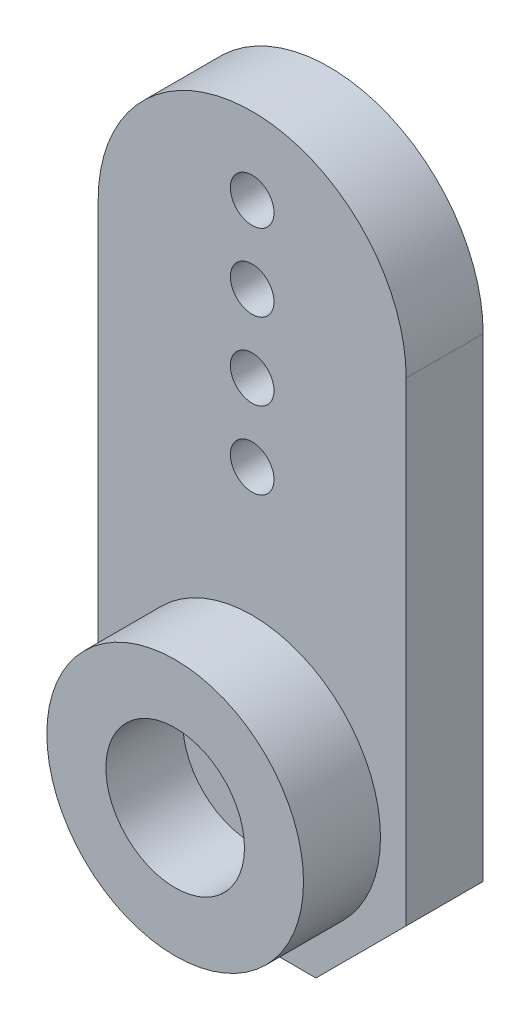
ISO-10303-21;
HEADER;
FILE_DESCRIPTION(('STEP AP214'),'2;1');
FILE_NAME('part.step','',(''),(''),'','','');
FILE_SCHEMA(('AUTOMOTIVE_DESIGN { 1 0 10303 214 1 1 1 1 }'));
ENDSEC;
DATA;
#1=APPLICATION_CONTEXT('core data for automotive mechanical design processes');
#2=APPLICATION_PROTOCOL_DEFINITION('international standard','automotive_design',2000,#1);
#3=PRODUCT_CONTEXT('',#1,'mechanical');
#4=PRODUCT('Part','Part','',(#3));
#5=PRODUCT_RELATED_PRODUCT_CATEGORY('part','',(#4));
#6=PRODUCT_DEFINITION_FORMATION('','',#4);
#7=PRODUCT_DEFINITION_CONTEXT('part definition',#1,'design');
#8=PRODUCT_DEFINITION('design','',#6,#7);
#9=PRODUCT_DEFINITION_SHAPE('','',#8);
#10=(LENGTH_UNIT() NAMED_UNIT(*) SI_UNIT(.MILLI.,.METRE.));
#11=(NAMED_UNIT(*) PLANE_ANGLE_UNIT() SI_UNIT($,.RADIAN.));
#12=(NAMED_UNIT(*) SI_UNIT($,.STERADIAN.) SOLID_ANGLE_UNIT());
#13=UNCERTAINTY_MEASURE_WITH_UNIT(LENGTH_MEASURE(1.E-05),#10,'distance_accuracy_value','');
#14=(GEOMETRIC_REPRESENTATION_CONTEXT(3) GLOBAL_UNCERTAINTY_ASSIGNED_CONTEXT((#13)) GLOBAL_UNIT_ASSIGNED_CONTEXT((#10,
#11,#12)) REPRESENTATION_CONTEXT('',''));
#15=CARTESIAN_POINT('',(0.,0.,0.));
#16=DIRECTION('',(0.,0.,1.));
#17=DIRECTION('',(1.,0.,0.));
#18=AXIS2_PLACEMENT_3D('',#15,#16,#17);
#19=CARTESIAN_POINT('',(0.,0.,3.));
#20=DIRECTION('',(0.,0.,-1.));
#21=DIRECTION('',(-1.,0.,0.));
#22=AXIS2_PLACEMENT_3D('',#19,#20,#21);
#23=CYLINDRICAL_SURFACE('',#22,1.35);
#24=CARTESIAN_POINT('',(0.,0.,3.));
#25=DIRECTION('',(0.,0.,1.));
#26=DIRECTION('',(1.,0.,0.));
#27=AXIS2_PLACEMENT_3D('',#24,#25,#26);
#28=CIRCLE('',#27,1.35);
#29=CARTESIAN_POINT('',(1.35,0.,3.));
#30=VERTEX_POINT('',#29);
#31=EDGE_CURVE('E123',#30,#30,#28,.T.);
#32=ORIENTED_EDGE('',*,*,#31,.T.);
#33=EDGE_LOOP('',(#32));
#34=FACE_BOUND('',#33,.T.);
#35=CARTESIAN_POINT('',(0.,0.,1.5));
#36=DIRECTION('',(0.,0.,-1.));
#37=DIRECTION('',(-1.,0.,0.));
#38=AXIS2_PLACEMENT_3D('',#35,#36,#37);
#39=CIRCLE('',#38,1.35);
#40=CARTESIAN_POINT('',(-1.35,0.,1.5));
#41=VERTEX_POINT('',#40);
#42=EDGE_CURVE('E35',#41,#41,#39,.T.);
#43=ORIENTED_EDGE('',*,*,#42,.T.);
#44=EDGE_LOOP('',(#43));
#45=FACE_BOUND('',#44,.T.);
#46=ADVANCED_FACE('F31',(#34,#45),#23,.F.);
#47=CARTESIAN_POINT('',(0.,16.,3.));
#48=DIRECTION('',(0.,0.,-1.));
#49=DIRECTION('',(-1.,0.,0.));
#50=AXIS2_PLACEMENT_3D('',#47,#48,#49);
#51=PLANE('',#50);
#52=CARTESIAN_POINT('',(0.,16.,3.));
#53=DIRECTION('',(0.,0.,1.));
#54=DIRECTION('',(1.,0.,0.));
#55=AXIS2_PLACEMENT_3D('',#52,#53,#54);
#56=CIRCLE('',#55,0.85);
#57=CARTESIAN_POINT('',(0.85,16.,3.));
#58=VERTEX_POINT('',#57);
#59=EDGE_CURVE('E163',#58,#58,#56,.T.);
#60=ORIENTED_EDGE('',*,*,#59,.F.);
#61=EDGE_LOOP('',(#60));
#62=FACE_BOUND('',#61,.T.);
#63=CARTESIAN_POINT('',(0.,10.,3.));
#64=DIRECTION('',(0.,0.,1.));
#65=DIRECTION('',(1.,0.,0.));
#66=AXIS2_PLACEMENT_3D('',#63,#64,#65);
#67=CIRCLE('',#66,0.85);
#68=CARTESIAN_POINT('',(0.85,10.,3.));
#69=VERTEX_POINT('',#68);
#70=EDGE_CURVE('E153',#69,#69,#67,.T.);
#71=ORIENTED_EDGE('',*,*,#70,.F.);
#72=EDGE_LOOP('',(#71));
#73=FACE_BOUND('',#72,.T.);
#74=CARTESIAN_POINT('',(0.,16.,3.));
#75=DIRECTION('',(0.,0.,1.));
#76=DIRECTION('',(-1.,0.,0.));
#77=AXIS2_PLACEMENT_3D('',#74,#75,#76);
#78=CIRCLE('',#77,6.);
#79=CARTESIAN_POINT('',(6.,16.,3.));
#80=VERTEX_POINT('',#79);
#81=CARTESIAN_POINT('',(-6.,16.,3.));
#82=VERTEX_POINT('',#81);
#83=EDGE_CURVE('E130',#80,#82,#78,.T.);
#84=ORIENTED_EDGE('',*,*,#83,.T.);
#85=DIRECTION('',(0.,-1.,0.));
#86=VECTOR('',#85,1.);
#87=CARTESIAN_POINT('',(-6.00000000000021,-2.48528137423843,3.));
#88=LINE('',#87,#86);
#89=CARTESIAN_POINT('',(-6.00000000000021,-2.48528137423843,3.));
#90=VERTEX_POINT('',#89);
#91=EDGE_CURVE('E87',#82,#90,#88,.T.);
#92=ORIENTED_EDGE('',*,*,#91,.T.);
#93=DIRECTION('',(0.707106781186562,-0.707106781186533,0.));
#94=VECTOR('',#93,1.);
#95=CARTESIAN_POINT('',(-2.4852813742385,-6.,3.));
#96=LINE('',#95,#94);
#97=CARTESIAN_POINT('',(-2.4852813742385,-6.,3.));
#98=VERTEX_POINT('',#97);
#99=EDGE_CURVE('E101',#90,#98,#96,.T.);
#100=ORIENTED_EDGE('',*,*,#99,.T.);
#101=DIRECTION('',(1.,0.,0.));
#102=VECTOR('',#101,1.);
#103=CARTESIAN_POINT('',(2.48528137423823,-6.,3.));
#104=LINE('',#103,#102);
#105=CARTESIAN_POINT('',(2.48528137423823,-6.,3.));
#106=VERTEX_POINT('',#105);
#107=EDGE_CURVE('E94',#98,#106,#104,.T.);
#108=ORIENTED_EDGE('',*,*,#107,.T.);
#109=DIRECTION('',(0.707106781186575,0.70710678118652,0.));
#110=VECTOR('',#109,1.);
#111=CARTESIAN_POINT('',(6.,-2.48528137423849,3.));
#112=LINE('',#111,#110);
#113=CARTESIAN_POINT('',(6.,-2.48528137423849,3.));
#114=VERTEX_POINT('',#113);
#115=EDGE_CURVE('E99',#106,#114,#112,.T.);
#116=ORIENTED_EDGE('',*,*,#115,.T.);
#117=DIRECTION('',(0.,1.,0.));
#118=VECTOR('',#117,1.);
#119=CARTESIAN_POINT('',(6.,16.,3.));
#120=LINE('',#119,#118);
#121=EDGE_CURVE('E49',#114,#80,#120,.T.);
#122=ORIENTED_EDGE('',*,*,#121,.T.);
#123=EDGE_LOOP('',(#84,#92,#100,#108,#116,#122));
#124=FACE_BOUND('',#123,.T.);
#125=CARTESIAN_POINT('',(0.,13.,3.));
#126=DIRECTION('',(0.,0.,1.));
#127=DIRECTION('',(1.,0.,0.));
#128=AXIS2_PLACEMENT_3D('',#125,#126,#127);
#129=CIRCLE('',#128,0.85);
#130=CARTESIAN_POINT('',(0.85,13.,3.));
#131=VERTEX_POINT('',#130);
#132=EDGE_CURVE('E157',#131,#131,#129,.T.);
#133=ORIENTED_EDGE('',*,*,#132,.F.);
#134=EDGE_LOOP('',(#133));
#135=FACE_BOUND('',#134,.T.);
#136=CARTESIAN_POINT('',(0.,19.,3.));
#137=DIRECTION('',(0.,0.,1.));
#138=DIRECTION('',(1.,0.,0.));
#139=AXIS2_PLACEMENT_3D('',#136,#137,#138);
#140=CIRCLE('',#139,0.85);
#141=CARTESIAN_POINT('',(0.85,19.,3.));
#142=VERTEX_POINT('',#141);
#143=EDGE_CURVE('E169',#142,#142,#140,.T.);
#144=ORIENTED_EDGE('',*,*,#143,.F.);
#145=EDGE_LOOP('',(#144));
#146=FACE_BOUND('',#145,.T.);
#147=CARTESIAN_POINT('',(0.,0.,3.));
#148=DIRECTION('',(0.,0.,-1.));
#149=DIRECTION('',(-1.,0.,0.));
#150=AXIS2_PLACEMENT_3D('',#147,#148,#149);
#151=CIRCLE('',#150,5.);
#152=CARTESIAN_POINT('',(-5.,0.,3.));
#153=VERTEX_POINT('',#152);
#154=EDGE_CURVE('E11',#153,#153,#151,.F.);
#155=ORIENTED_EDGE('',*,*,#154,.F.);
#156=EDGE_LOOP('',(#155));
#157=FACE_BOUND('',#156,.T.);
#158=ADVANCED_FACE('F96',(#62,#73,#124,#135,#146,#157),#51,.F.);
#159=CARTESIAN_POINT('',(0.,0.,3.));
#160=DIRECTION('',(0.,0.,1.));
#161=DIRECTION('',(1.,0.,0.));
#162=AXIS2_PLACEMENT_3D('',#159,#160,#161);
#163=CIRCLE('',#162,2.7);
#164=CARTESIAN_POINT('',(2.7,0.,3.));
#165=VERTEX_POINT('',#164);
#166=EDGE_CURVE('E181',#165,#165,#163,.T.);
#167=ORIENTED_EDGE('',*,*,#166,.T.);
#168=EDGE_LOOP('',(#167));
#169=FACE_BOUND('',#168,.T.);
#170=ORIENTED_EDGE('',*,*,#31,.F.);
#171=EDGE_LOOP('',(#170));
#172=FACE_BOUND('',#171,.T.);
#173=ADVANCED_FACE('F213',(#169,#172),#51,.F.);
#174=CARTESIAN_POINT('',(0.,16.,0.));
#175=DIRECTION('',(0.,0.,-1.));
#176=DIRECTION('',(-1.,0.,0.));
#177=AXIS2_PLACEMENT_3D('',#174,#175,#176);
#178=PLANE('',#177);
#179=CARTESIAN_POINT('',(0.,0.,0.));
#180=DIRECTION('',(0.,0.,-1.));
#181=DIRECTION('',(-1.,0.,0.));
#182=AXIS2_PLACEMENT_3D('',#179,#180,#181);
#183=CIRCLE('',#182,3.);
#184=CARTESIAN_POINT('',(-3.,0.,0.));
#185=VERTEX_POINT('',#184);
#186=EDGE_CURVE('E186',#185,#185,#183,.T.);
#187=ORIENTED_EDGE('',*,*,#186,.F.);
#188=EDGE_LOOP('',(#187));
#189=FACE_BOUND('',#188,.T.);
#190=CARTESIAN_POINT('',(0.,16.,0.));
#191=DIRECTION('',(0.,0.,1.));
#192=DIRECTION('',(1.,0.,0.));
#193=AXIS2_PLACEMENT_3D('',#190,#191,#192);
#194=CIRCLE('',#193,0.85);
#195=CARTESIAN_POINT('',(0.85,16.,0.));
#196=VERTEX_POINT('',#195);
#197=EDGE_CURVE('E166',#196,#196,#194,.T.);
#198=ORIENTED_EDGE('',*,*,#197,.T.);
#199=EDGE_LOOP('',(#198));
#200=FACE_BOUND('',#199,.T.);
#201=CARTESIAN_POINT('',(0.,10.,0.));
#202=DIRECTION('',(0.,0.,1.));
#203=DIRECTION('',(1.,0.,0.));
#204=AXIS2_PLACEMENT_3D('',#201,#202,#203);
#205=CIRCLE('',#204,0.85);
#206=CARTESIAN_POINT('',(0.85,10.,0.));
#207=VERTEX_POINT('',#206);
#208=EDGE_CURVE('E154',#207,#207,#205,.T.);
#209=ORIENTED_EDGE('',*,*,#208,.T.);
#210=EDGE_LOOP('',(#209));
#211=FACE_BOUND('',#210,.T.);
#212=CARTESIAN_POINT('',(0.,16.,0.));
#213=DIRECTION('',(0.,0.,1.));
#214=DIRECTION('',(-1.,0.,0.));
#215=AXIS2_PLACEMENT_3D('',#212,#213,#214);
#216=CIRCLE('',#215,6.);
#217=CARTESIAN_POINT('',(6.,16.,0.));
#218=VERTEX_POINT('',#217);
#219=CARTESIAN_POINT('',(-6.,16.,0.));
#220=VERTEX_POINT('',#219);
#221=EDGE_CURVE('E119',#218,#220,#216,.T.);
#222=ORIENTED_EDGE('',*,*,#221,.F.);
#223=DIRECTION('',(0.,1.,0.));
#224=VECTOR('',#223,1.);
#225=CARTESIAN_POINT('',(6.,16.,0.));
#226=LINE('',#225,#224);
#227=CARTESIAN_POINT('',(6.,-2.48528137423849,0.));
#228=VERTEX_POINT('',#227);
#229=EDGE_CURVE('E78',#228,#218,#226,.T.);
#230=ORIENTED_EDGE('',*,*,#229,.F.);
#231=DIRECTION('',(0.707106781186575,0.70710678118652,0.));
#232=VECTOR('',#231,1.);
#233=CARTESIAN_POINT('',(6.,-2.48528137423849,0.));
#234=LINE('',#233,#232);
#235=CARTESIAN_POINT('',(2.48528137423823,-6.,0.));
#236=VERTEX_POINT('',#235);
#237=EDGE_CURVE('E72',#236,#228,#234,.T.);
#238=ORIENTED_EDGE('',*,*,#237,.F.);
#239=DIRECTION('',(1.,0.,0.));
#240=VECTOR('',#239,1.);
#241=CARTESIAN_POINT('',(2.48528137423823,-6.,0.));
#242=LINE('',#241,#240);
#243=CARTESIAN_POINT('',(-2.4852813742385,-6.,0.));
#244=VERTEX_POINT('',#243);
#245=EDGE_CURVE('E109',#244,#236,#242,.T.);
#246=ORIENTED_EDGE('',*,*,#245,.F.);
#247=DIRECTION('',(0.707106781186562,-0.707106781186533,0.));
#248=VECTOR('',#247,1.);
#249=CARTESIAN_POINT('',(-2.4852813742385,-6.,0.));
#250=LINE('',#249,#248);
#251=CARTESIAN_POINT('',(-6.00000000000021,-2.48528137423843,0.));
#252=VERTEX_POINT('',#251);
#253=EDGE_CURVE('E125',#252,#244,#250,.T.);
#254=ORIENTED_EDGE('',*,*,#253,.F.);
#255=DIRECTION('',(0.,-1.,0.));
#256=VECTOR('',#255,1.);
#257=CARTESIAN_POINT('',(-6.00000000000021,-2.48528137423843,0.));
#258=LINE('',#257,#256);
#259=EDGE_CURVE('E122',#220,#252,#258,.T.);
#260=ORIENTED_EDGE('',*,*,#259,.F.);
#261=EDGE_LOOP('',(#222,#230,#238,#246,#254,#260));
#262=FACE_BOUND('',#261,.T.);
#263=CARTESIAN_POINT('',(0.,13.,0.));
#264=DIRECTION('',(0.,0.,1.));
#265=DIRECTION('',(1.,0.,0.));
#266=AXIS2_PLACEMENT_3D('',#263,#264,#265);
#267=CIRCLE('',#266,0.85);
#268=CARTESIAN_POINT('',(0.85,13.,0.));
#269=VERTEX_POINT('',#268);
#270=EDGE_CURVE('E160',#269,#269,#267,.T.);
#271=ORIENTED_EDGE('',*,*,#270,.T.);
#272=EDGE_LOOP('',(#271));
#273=FACE_BOUND('',#272,.T.);
#274=CARTESIAN_POINT('',(0.,19.,0.));
#275=DIRECTION('',(0.,0.,1.));
#276=DIRECTION('',(1.,0.,0.));
#277=AXIS2_PLACEMENT_3D('',#274,#275,#276);
#278=CIRCLE('',#277,0.85);
#279=CARTESIAN_POINT('',(0.85,19.,0.));
#280=VERTEX_POINT('',#279);
#281=EDGE_CURVE('E172',#280,#280,#278,.T.);
#282=ORIENTED_EDGE('',*,*,#281,.T.);
#283=EDGE_LOOP('',(#282));
#284=FACE_BOUND('',#283,.T.);
#285=ADVANCED_FACE('F143',(#189,#200,#211,#262,#273,#284),#178,.T.);
#286=CARTESIAN_POINT('',(0.,16.,3.));
#287=DIRECTION('',(0.,0.,-1.));
#288=DIRECTION('',(-1.,0.,0.));
#289=AXIS2_PLACEMENT_3D('',#286,#287,#288);
#290=CYLINDRICAL_SURFACE('',#289,6.);
#291=ORIENTED_EDGE('',*,*,#221,.T.);
#292=DIRECTION('',(0.,0.,-1.));
#293=VECTOR('',#292,1.);
#294=CARTESIAN_POINT('',(-6.,16.,3.));
#295=LINE('',#294,#293);
#296=EDGE_CURVE('E41',#82,#220,#295,.T.);
#297=ORIENTED_EDGE('',*,*,#296,.F.);
#298=ORIENTED_EDGE('',*,*,#83,.F.);
#299=DIRECTION('',(0.,0.,-1.));
#300=VECTOR('',#299,1.);
#301=CARTESIAN_POINT('',(6.,16.,3.));
#302=LINE('',#301,#300);
#303=EDGE_CURVE('E115',#80,#218,#302,.T.);
#304=ORIENTED_EDGE('',*,*,#303,.T.);
#305=EDGE_LOOP('',(#291,#297,#298,#304));
#306=FACE_BOUND('',#305,.T.);
#307=ADVANCED_FACE('F33',(#306),#290,.T.);
#308=CARTESIAN_POINT('',(-6.00000000000021,-2.48528137423843,3.));
#309=DIRECTION('',(1.,0.,0.));
#310=DIRECTION('',(0.,1.,0.));
#311=AXIS2_PLACEMENT_3D('',#308,#309,#310);
#312=PLANE('',#311);
#313=ORIENTED_EDGE('',*,*,#259,.T.);
#314=DIRECTION('',(0.,0.,-1.));
#315=VECTOR('',#314,1.);
#316=CARTESIAN_POINT('',(-6.00000000000021,-2.48528137423843,3.));
#317=LINE('',#316,#315);
#318=EDGE_CURVE('E134',#90,#252,#317,.T.);
#319=ORIENTED_EDGE('',*,*,#318,.F.);
#320=ORIENTED_EDGE('',*,*,#91,.F.);
#321=ORIENTED_EDGE('',*,*,#296,.T.);
#322=EDGE_LOOP('',(#313,#319,#320,#321));
#323=FACE_BOUND('',#322,.T.);
#324=ADVANCED_FACE('F138',(#323),#312,.F.);
#325=CARTESIAN_POINT('',(-2.4852813742385,-6.,3.));
#326=DIRECTION('',(0.707106781186533,0.707106781186562,0.));
#327=DIRECTION('',(-0.707106781186562,0.707106781186533,0.));
#328=AXIS2_PLACEMENT_3D('',#325,#326,#327);
#329=PLANE('',#328);
#330=ORIENTED_EDGE('',*,*,#253,.T.);
#331=DIRECTION('',(0.,0.,-1.));
#332=VECTOR('',#331,1.);
#333=CARTESIAN_POINT('',(-2.4852813742385,-6.,3.));
#334=LINE('',#333,#332);
#335=EDGE_CURVE('E110',#98,#244,#334,.T.);
#336=ORIENTED_EDGE('',*,*,#335,.F.);
#337=ORIENTED_EDGE('',*,*,#99,.F.);
#338=ORIENTED_EDGE('',*,*,#318,.T.);
#339=EDGE_LOOP('',(#330,#336,#337,#338));
#340=FACE_BOUND('',#339,.T.);
#341=ADVANCED_FACE('F147',(#340),#329,.F.);
#342=CARTESIAN_POINT('',(2.48528137423823,-6.,3.));
#343=DIRECTION('',(0.,1.,0.));
#344=DIRECTION('',(-1.,0.,0.));
#345=AXIS2_PLACEMENT_3D('',#342,#343,#344);
#346=PLANE('',#345);
#347=ORIENTED_EDGE('',*,*,#245,.T.);
#348=DIRECTION('',(0.,0.,-1.));
#349=VECTOR('',#348,1.);
#350=CARTESIAN_POINT('',(2.48528137423823,-6.,3.));
#351=LINE('',#350,#349);
#352=EDGE_CURVE('E106',#106,#236,#351,.T.);
#353=ORIENTED_EDGE('',*,*,#352,.F.);
#354=ORIENTED_EDGE('',*,*,#107,.F.);
#355=ORIENTED_EDGE('',*,*,#335,.T.);
#356=EDGE_LOOP('',(#347,#353,#354,#355));
#357=FACE_BOUND('',#356,.T.);
#358=ADVANCED_FACE('F107',(#357),#346,.F.);
#359=CARTESIAN_POINT('',(6.,-2.48528137423849,3.));
#360=DIRECTION('',(-0.70710678118652,0.707106781186575,0.));
#361=DIRECTION('',(-0.707106781186575,-0.70710678118652,0.));
#362=AXIS2_PLACEMENT_3D('',#359,#360,#361);
#363=PLANE('',#362);
#364=ORIENTED_EDGE('',*,*,#237,.T.);
#365=DIRECTION('',(0.,0.,-1.));
#366=VECTOR('',#365,1.);
#367=CARTESIAN_POINT('',(6.,-2.48528137423849,3.));
#368=LINE('',#367,#366);
#369=EDGE_CURVE('E111',#114,#228,#368,.T.);
#370=ORIENTED_EDGE('',*,*,#369,.F.);
#371=ORIENTED_EDGE('',*,*,#115,.F.);
#372=ORIENTED_EDGE('',*,*,#352,.T.);
#373=EDGE_LOOP('',(#364,#370,#371,#372));
#374=FACE_BOUND('',#373,.T.);
#375=ADVANCED_FACE('F113',(#374),#363,.F.);
#376=CARTESIAN_POINT('',(6.,16.,3.));
#377=DIRECTION('',(-1.,0.,0.));
#378=DIRECTION('',(0.,-1.,0.));
#379=AXIS2_PLACEMENT_3D('',#376,#377,#378);
#380=PLANE('',#379);
#381=ORIENTED_EDGE('',*,*,#229,.T.);
#382=ORIENTED_EDGE('',*,*,#303,.F.);
#383=ORIENTED_EDGE('',*,*,#121,.F.);
#384=ORIENTED_EDGE('',*,*,#369,.T.);
#385=EDGE_LOOP('',(#381,#382,#383,#384));
#386=FACE_BOUND('',#385,.T.);
#387=ADVANCED_FACE('F225',(#386),#380,.F.);
#388=CARTESIAN_POINT('',(0.,10.,3.));
#389=DIRECTION('',(0.,0.,-1.));
#390=DIRECTION('',(-1.,0.,0.));
#391=AXIS2_PLACEMENT_3D('',#388,#389,#390);
#392=CYLINDRICAL_SURFACE('',#391,0.85);
#393=ORIENTED_EDGE('',*,*,#70,.T.);
#394=EDGE_LOOP('',(#393));
#395=FACE_BOUND('',#394,.T.);
#396=ORIENTED_EDGE('',*,*,#208,.F.);
#397=EDGE_LOOP('',(#396));
#398=FACE_BOUND('',#397,.T.);
#399=ADVANCED_FACE('F217',(#395,#398),#392,.F.);
#400=CARTESIAN_POINT('',(0.,13.,3.));
#401=DIRECTION('',(0.,0.,-1.));
#402=DIRECTION('',(-1.,0.,0.));
#403=AXIS2_PLACEMENT_3D('',#400,#401,#402);
#404=CYLINDRICAL_SURFACE('',#403,0.85);
#405=ORIENTED_EDGE('',*,*,#132,.T.);
#406=EDGE_LOOP('',(#405));
#407=FACE_BOUND('',#406,.T.);
#408=ORIENTED_EDGE('',*,*,#270,.F.);
#409=EDGE_LOOP('',(#408));
#410=FACE_BOUND('',#409,.T.);
#411=ADVANCED_FACE('F276',(#407,#410),#404,.F.);
#412=CARTESIAN_POINT('',(0.,16.,3.));
#413=DIRECTION('',(0.,0.,-1.));
#414=DIRECTION('',(-1.,0.,0.));
#415=AXIS2_PLACEMENT_3D('',#412,#413,#414);
#416=CYLINDRICAL_SURFACE('',#415,0.85);
#417=ORIENTED_EDGE('',*,*,#59,.T.);
#418=EDGE_LOOP('',(#417));
#419=FACE_BOUND('',#418,.T.);
#420=ORIENTED_EDGE('',*,*,#197,.F.);
#421=EDGE_LOOP('',(#420));
#422=FACE_BOUND('',#421,.T.);
#423=ADVANCED_FACE('F265',(#419,#422),#416,.F.);
#424=CARTESIAN_POINT('',(0.,19.,3.));
#425=DIRECTION('',(0.,0.,-1.));
#426=DIRECTION('',(-1.,0.,0.));
#427=AXIS2_PLACEMENT_3D('',#424,#425,#426);
#428=CYLINDRICAL_SURFACE('',#427,0.85);
#429=ORIENTED_EDGE('',*,*,#143,.T.);
#430=EDGE_LOOP('',(#429));
#431=FACE_BOUND('',#430,.T.);
#432=ORIENTED_EDGE('',*,*,#281,.F.);
#433=EDGE_LOOP('',(#432));
#434=FACE_BOUND('',#433,.T.);
#435=ADVANCED_FACE('F260',(#431,#434),#428,.F.);
#436=CARTESIAN_POINT('',(0.,0.,6.));
#437=DIRECTION('',(0.,0.,1.));
#438=DIRECTION('',(1.,0.,0.));
#439=AXIS2_PLACEMENT_3D('',#436,#437,#438);
#440=PLANE('',#439);
#441=CARTESIAN_POINT('',(0.,0.,6.));
#442=DIRECTION('',(0.,0.,1.));
#443=DIRECTION('',(1.,0.,0.));
#444=AXIS2_PLACEMENT_3D('',#441,#442,#443);
#445=CIRCLE('',#444,5.);
#446=CARTESIAN_POINT('',(5.,0.,6.));
#447=VERTEX_POINT('',#446);
#448=EDGE_CURVE('E175',#447,#447,#445,.T.);
#449=ORIENTED_EDGE('',*,*,#448,.T.);
#450=EDGE_LOOP('',(#449));
#451=FACE_BOUND('',#450,.T.);
#452=CARTESIAN_POINT('',(0.,0.,6.));
#453=DIRECTION('',(0.,0.,1.));
#454=DIRECTION('',(1.,0.,0.));
#455=AXIS2_PLACEMENT_3D('',#452,#453,#454);
#456=CIRCLE('',#455,2.7);
#457=CARTESIAN_POINT('',(2.7,0.,6.));
#458=VERTEX_POINT('',#457);
#459=EDGE_CURVE('E180',#458,#458,#456,.T.);
#460=ORIENTED_EDGE('',*,*,#459,.F.);
#461=EDGE_LOOP('',(#460));
#462=FACE_BOUND('',#461,.T.);
#463=ADVANCED_FACE('F264',(#451,#462),#440,.T.);
#464=CARTESIAN_POINT('',(0.,0.,6.));
#465=DIRECTION('',(0.,0.,-1.));
#466=DIRECTION('',(-1.,0.,0.));
#467=AXIS2_PLACEMENT_3D('',#464,#465,#466);
#468=CYLINDRICAL_SURFACE('',#467,5.);
#469=ORIENTED_EDGE('',*,*,#448,.F.);
#470=EDGE_LOOP('',(#469));
#471=FACE_BOUND('',#470,.T.);
#472=ORIENTED_EDGE('',*,*,#154,.T.);
#473=EDGE_LOOP('',(#472));
#474=FACE_BOUND('',#473,.T.);
#475=ADVANCED_FACE('F338',(#471,#474),#468,.T.);
#476=CARTESIAN_POINT('',(0.,0.,6.));
#477=DIRECTION('',(0.,0.,-1.));
#478=DIRECTION('',(-1.,0.,0.));
#479=AXIS2_PLACEMENT_3D('',#476,#477,#478);
#480=CYLINDRICAL_SURFACE('',#479,2.7);
#481=ORIENTED_EDGE('',*,*,#459,.T.);
#482=EDGE_LOOP('',(#481));
#483=FACE_BOUND('',#482,.T.);
#484=ORIENTED_EDGE('',*,*,#166,.F.);
#485=EDGE_LOOP('',(#484));
#486=FACE_BOUND('',#485,.T.);
#487=ADVANCED_FACE('F204',(#483,#486),#480,.F.);
#488=CARTESIAN_POINT('',(0.,0.,1.5));
#489=DIRECTION('',(0.,0.,-1.));
#490=DIRECTION('',(-1.,0.,0.));
#491=AXIS2_PLACEMENT_3D('',#488,#489,#490);
#492=CYLINDRICAL_SURFACE('',#491,3.);
#493=CARTESIAN_POINT('',(0.,0.,1.5));
#494=DIRECTION('',(0.,0.,-1.));
#495=DIRECTION('',(-1.,0.,0.));
#496=AXIS2_PLACEMENT_3D('',#493,#494,#495);
#497=CIRCLE('',#496,3.);
#498=CARTESIAN_POINT('',(-3.,0.,1.5));
#499=VERTEX_POINT('',#498);
#500=EDGE_CURVE('E189',#499,#499,#497,.T.);
#501=ORIENTED_EDGE('',*,*,#500,.F.);
#502=EDGE_LOOP('',(#501));
#503=FACE_BOUND('',#502,.T.);
#504=ORIENTED_EDGE('',*,*,#186,.T.);
#505=EDGE_LOOP('',(#504));
#506=FACE_BOUND('',#505,.T.);
#507=ADVANCED_FACE('F199',(#503,#506),#492,.F.);
#508=CARTESIAN_POINT('',(0.,0.,1.5));
#509=DIRECTION('',(0.,0.,-1.));
#510=DIRECTION('',(-1.,0.,0.));
#511=AXIS2_PLACEMENT_3D('',#508,#509,#510);
#512=PLANE('',#511);
#513=ORIENTED_EDGE('',*,*,#42,.F.);
#514=EDGE_LOOP('',(#513));
#515=FACE_BOUND('',#514,.T.);
#516=ORIENTED_EDGE('',*,*,#500,.T.);
#517=EDGE_LOOP('',(#516));
#518=FACE_BOUND('',#517,.T.);
#519=ADVANCED_FACE('F197',(#515,#518),#512,.T.);
#520=CLOSED_SHELL('',(#46,#158,#173,#285,#307,#324,#341,#358,#375,#387,#399,#411,#423,#435,#463,
#475,#487,#507,#519));
#521=MANIFOLD_SOLID_BREP('B2',#520);
#522=ADVANCED_BREP_SHAPE_REPRESENTATION('',(#18,#521),#14);
#523=SHAPE_DEFINITION_REPRESENTATION(#9,#522);
ENDSEC;
END-ISO-10303-21;
